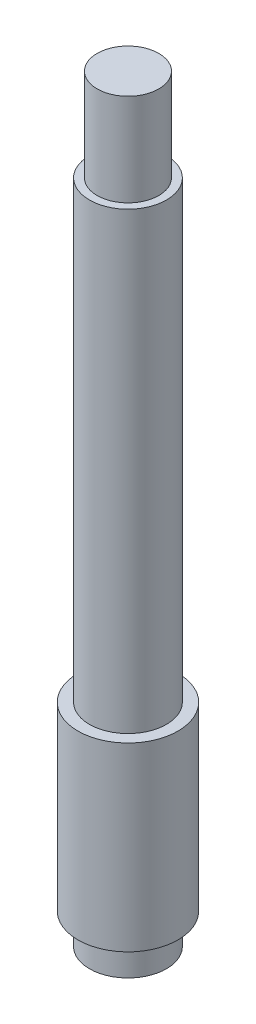
ISO-10303-21;
HEADER;
FILE_DESCRIPTION(('STEP AP214'),'2;1');
FILE_NAME('part.step','',(''),(''),'','','');
FILE_SCHEMA(('AUTOMOTIVE_DESIGN { 1 0 10303 214 1 1 1 1 }'));
ENDSEC;
DATA;
#1=APPLICATION_CONTEXT('core data for automotive mechanical design processes');
#2=APPLICATION_PROTOCOL_DEFINITION('international standard','automotive_design',2000,#1);
#3=PRODUCT_CONTEXT('',#1,'mechanical');
#4=PRODUCT('Part','Part','',(#3));
#5=PRODUCT_RELATED_PRODUCT_CATEGORY('part','',(#4));
#6=PRODUCT_DEFINITION_FORMATION('','',#4);
#7=PRODUCT_DEFINITION_CONTEXT('part definition',#1,'design');
#8=PRODUCT_DEFINITION('design','',#6,#7);
#9=PRODUCT_DEFINITION_SHAPE('','',#8);
#10=(LENGTH_UNIT() NAMED_UNIT(*) SI_UNIT(.MILLI.,.METRE.));
#11=(NAMED_UNIT(*) PLANE_ANGLE_UNIT() SI_UNIT($,.RADIAN.));
#12=(NAMED_UNIT(*) SI_UNIT($,.STERADIAN.) SOLID_ANGLE_UNIT());
#13=UNCERTAINTY_MEASURE_WITH_UNIT(LENGTH_MEASURE(1.E-05),#10,'distance_accuracy_value','');
#14=(GEOMETRIC_REPRESENTATION_CONTEXT(3) GLOBAL_UNCERTAINTY_ASSIGNED_CONTEXT((#13)) GLOBAL_UNIT_ASSIGNED_CONTEXT((#10,
#11,#12)) REPRESENTATION_CONTEXT('',''));
#15=CARTESIAN_POINT('',(0.,0.,0.));
#16=DIRECTION('',(0.,0.,1.));
#17=DIRECTION('',(1.,0.,0.));
#18=AXIS2_PLACEMENT_3D('',#15,#16,#17);
#19=CARTESIAN_POINT('',(0.,98.5,0.));
#20=DIRECTION('',(0.,-1.,0.));
#21=DIRECTION('',(0.,0.,-1.));
#22=AXIS2_PLACEMENT_3D('',#19,#20,#21);
#23=PLANE('',#22);
#24=CARTESIAN_POINT('',(0.,98.5,0.));
#25=DIRECTION('',(0.,1.,0.));
#26=DIRECTION('',(0.,0.,1.));
#27=AXIS2_PLACEMENT_3D('',#24,#25,#26);
#28=CIRCLE('',#27,4.00000000000004);
#29=CARTESIAN_POINT('',(0.,98.5,4.00000000000004));
#30=VERTEX_POINT('',#29);
#31=EDGE_CURVE('E10',#30,#30,#28,.T.);
#32=ORIENTED_EDGE('',*,*,#31,.T.);
#33=EDGE_LOOP('',(#32));
#34=FACE_BOUND('',#33,.T.);
#35=ADVANCED_FACE('F31',(#34),#23,.F.);
#36=CARTESIAN_POINT('',(0.,463.328385711035,0.));
#37=DIRECTION('',(0.,1.,0.));
#38=DIRECTION('',(0.,0.,1.));
#39=AXIS2_PLACEMENT_3D('',#36,#37,#38);
#40=CYLINDRICAL_SURFACE('',#39,4.00000000000005);
#41=ORIENTED_EDGE('',*,*,#31,.F.);
#42=EDGE_LOOP('',(#41));
#43=FACE_BOUND('',#42,.T.);
#44=CARTESIAN_POINT('',(0.,86.5,0.));
#45=DIRECTION('',(0.,1.,0.));
#46=DIRECTION('',(0.,0.,1.));
#47=AXIS2_PLACEMENT_3D('',#44,#45,#46);
#48=CIRCLE('',#47,4.00000000000005);
#49=CARTESIAN_POINT('',(0.,86.5,4.00000000000005));
#50=VERTEX_POINT('',#49);
#51=EDGE_CURVE('E37',#50,#50,#48,.T.);
#52=ORIENTED_EDGE('',*,*,#51,.T.);
#53=EDGE_LOOP('',(#52));
#54=FACE_BOUND('',#53,.T.);
#55=ADVANCED_FACE('F75',(#43,#54),#40,.T.);
#56=CARTESIAN_POINT('',(5.00000000000005,86.5,0.));
#57=DIRECTION('',(0.,-1.,0.));
#58=DIRECTION('',(0.,0.,-1.));
#59=AXIS2_PLACEMENT_3D('',#56,#57,#58);
#60=PLANE('',#59);
#61=ORIENTED_EDGE('',*,*,#51,.F.);
#62=EDGE_LOOP('',(#61));
#63=FACE_BOUND('',#62,.T.);
#64=CARTESIAN_POINT('',(0.,86.5,0.));
#65=DIRECTION('',(0.,1.,0.));
#66=DIRECTION('',(0.,0.,1.));
#67=AXIS2_PLACEMENT_3D('',#64,#65,#66);
#68=CIRCLE('',#67,5.00000000000005);
#69=CARTESIAN_POINT('',(0.,86.5,5.00000000000005));
#70=VERTEX_POINT('',#69);
#71=EDGE_CURVE('E41',#70,#70,#68,.T.);
#72=ORIENTED_EDGE('',*,*,#71,.T.);
#73=EDGE_LOOP('',(#72));
#74=FACE_BOUND('',#73,.T.);
#75=ADVANCED_FACE('F79',(#63,#74),#60,.F.);
#76=CARTESIAN_POINT('',(0.,463.328385711035,0.));
#77=DIRECTION('',(0.,1.,0.));
#78=DIRECTION('',(0.,0.,1.));
#79=AXIS2_PLACEMENT_3D('',#76,#77,#78);
#80=CYLINDRICAL_SURFACE('',#79,5.00000000000005);
#81=ORIENTED_EDGE('',*,*,#71,.F.);
#82=EDGE_LOOP('',(#81));
#83=FACE_BOUND('',#82,.T.);
#84=CARTESIAN_POINT('',(0.,27.5,0.));
#85=DIRECTION('',(0.,1.,0.));
#86=DIRECTION('',(0.,0.,1.));
#87=AXIS2_PLACEMENT_3D('',#84,#85,#86);
#88=CIRCLE('',#87,5.00000000000005);
#89=CARTESIAN_POINT('',(0.,27.5,5.00000000000005));
#90=VERTEX_POINT('',#89);
#91=EDGE_CURVE('E45',#90,#90,#88,.T.);
#92=ORIENTED_EDGE('',*,*,#91,.T.);
#93=EDGE_LOOP('',(#92));
#94=FACE_BOUND('',#93,.T.);
#95=ADVANCED_FACE('F84',(#83,#94),#80,.T.);
#96=CARTESIAN_POINT('',(6.50000000000005,27.5,0.));
#97=DIRECTION('',(0.,-1.,0.));
#98=DIRECTION('',(0.,0.,-1.));
#99=AXIS2_PLACEMENT_3D('',#96,#97,#98);
#100=PLANE('',#99);
#101=ORIENTED_EDGE('',*,*,#91,.F.);
#102=EDGE_LOOP('',(#101));
#103=FACE_BOUND('',#102,.T.);
#104=CARTESIAN_POINT('',(0.,27.5,0.));
#105=DIRECTION('',(0.,1.,0.));
#106=DIRECTION('',(0.,0.,1.));
#107=AXIS2_PLACEMENT_3D('',#104,#105,#106);
#108=CIRCLE('',#107,6.50000000000005);
#109=CARTESIAN_POINT('',(0.,27.5,6.50000000000005));
#110=VERTEX_POINT('',#109);
#111=EDGE_CURVE('E50',#110,#110,#108,.T.);
#112=ORIENTED_EDGE('',*,*,#111,.T.);
#113=EDGE_LOOP('',(#112));
#114=FACE_BOUND('',#113,.T.);
#115=ADVANCED_FACE('F90',(#103,#114),#100,.F.);
#116=CARTESIAN_POINT('',(0.,463.328385711035,0.));
#117=DIRECTION('',(0.,1.,0.));
#118=DIRECTION('',(0.,0.,1.));
#119=AXIS2_PLACEMENT_3D('',#116,#117,#118);
#120=CYLINDRICAL_SURFACE('',#119,6.50000000000005);
#121=ORIENTED_EDGE('',*,*,#111,.F.);
#122=EDGE_LOOP('',(#121));
#123=FACE_BOUND('',#122,.T.);
#124=CARTESIAN_POINT('',(0.,4.,0.));
#125=DIRECTION('',(0.,1.,0.));
#126=DIRECTION('',(0.,0.,1.));
#127=AXIS2_PLACEMENT_3D('',#124,#125,#126);
#128=CIRCLE('',#127,6.50000000000006);
#129=CARTESIAN_POINT('',(0.,4.,6.50000000000006));
#130=VERTEX_POINT('',#129);
#131=EDGE_CURVE('E53',#130,#130,#128,.T.);
#132=ORIENTED_EDGE('',*,*,#131,.T.);
#133=EDGE_LOOP('',(#132));
#134=FACE_BOUND('',#133,.T.);
#135=ADVANCED_FACE('F94',(#123,#134),#120,.T.);
#136=CARTESIAN_POINT('',(5.00000000000006,4.,0.));
#137=DIRECTION('',(0.,1.,0.));
#138=DIRECTION('',(0.,0.,1.));
#139=AXIS2_PLACEMENT_3D('',#136,#137,#138);
#140=PLANE('',#139);
#141=ORIENTED_EDGE('',*,*,#131,.F.);
#142=EDGE_LOOP('',(#141));
#143=FACE_BOUND('',#142,.T.);
#144=CARTESIAN_POINT('',(0.,4.,0.));
#145=DIRECTION('',(0.,1.,0.));
#146=DIRECTION('',(0.,0.,1.));
#147=AXIS2_PLACEMENT_3D('',#144,#145,#146);
#148=CIRCLE('',#147,5.00000000000006);
#149=CARTESIAN_POINT('',(0.,4.,5.00000000000006));
#150=VERTEX_POINT('',#149);
#151=EDGE_CURVE('E56',#150,#150,#148,.T.);
#152=ORIENTED_EDGE('',*,*,#151,.T.);
#153=EDGE_LOOP('',(#152));
#154=FACE_BOUND('',#153,.T.);
#155=ADVANCED_FACE('F71',(#143,#154),#140,.F.);
#156=CARTESIAN_POINT('',(0.,463.328385711035,0.));
#157=DIRECTION('',(0.,1.,0.));
#158=DIRECTION('',(0.,0.,1.));
#159=AXIS2_PLACEMENT_3D('',#156,#157,#158);
#160=CYLINDRICAL_SURFACE('',#159,5.00000000000006);
#161=ORIENTED_EDGE('',*,*,#151,.F.);
#162=EDGE_LOOP('',(#161));
#163=FACE_BOUND('',#162,.T.);
#164=CARTESIAN_POINT('',(0.,0.,0.));
#165=DIRECTION('',(0.,1.,0.));
#166=DIRECTION('',(0.,0.,1.));
#167=AXIS2_PLACEMENT_3D('',#164,#165,#166);
#168=CIRCLE('',#167,5.00000000000006);
#169=CARTESIAN_POINT('',(0.,0.,5.00000000000006));
#170=VERTEX_POINT('',#169);
#171=EDGE_CURVE('E59',#170,#170,#168,.T.);
#172=ORIENTED_EDGE('',*,*,#171,.T.);
#173=EDGE_LOOP('',(#172));
#174=FACE_BOUND('',#173,.T.);
#175=ADVANCED_FACE('F63',(#163,#174),#160,.T.);
#176=CARTESIAN_POINT('',(0.,0.,0.));
#177=DIRECTION('',(0.,1.,0.));
#178=DIRECTION('',(0.,0.,1.));
#179=AXIS2_PLACEMENT_3D('',#176,#177,#178);
#180=PLANE('',#179);
#181=ORIENTED_EDGE('',*,*,#171,.F.);
#182=EDGE_LOOP('',(#181));
#183=FACE_BOUND('',#182,.T.);
#184=ADVANCED_FACE('F65',(#183),#180,.F.);
#185=CLOSED_SHELL('',(#35,#55,#75,#95,#115,#135,#155,#175,#184));
#186=MANIFOLD_SOLID_BREP('B2',#185);
#187=ADVANCED_BREP_SHAPE_REPRESENTATION('',(#18,#186),#14);
#188=SHAPE_DEFINITION_REPRESENTATION(#9,#187);
ENDSEC;
END-ISO-10303-21;
